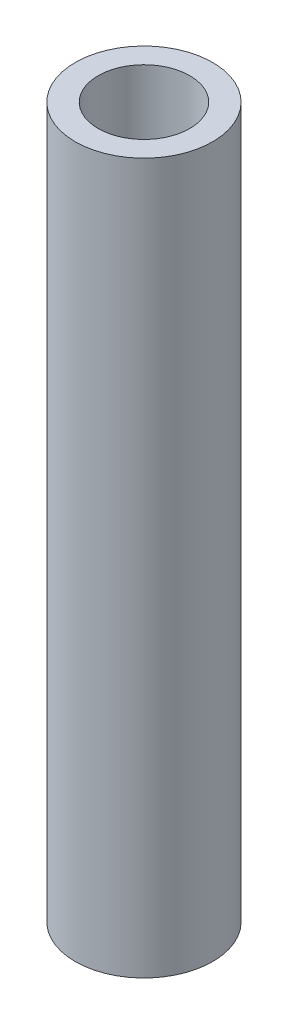
ISO-10303-21;
HEADER;
FILE_DESCRIPTION(('STEP AP214'),'2;1');
FILE_NAME('part.step','',(''),(''),'','','');
FILE_SCHEMA(('AUTOMOTIVE_DESIGN { 1 0 10303 214 1 1 1 1 }'));
ENDSEC;
DATA;
#1=APPLICATION_CONTEXT('core data for automotive mechanical design processes');
#2=APPLICATION_PROTOCOL_DEFINITION('international standard','automotive_design',2000,#1);
#3=PRODUCT_CONTEXT('',#1,'mechanical');
#4=PRODUCT('Part','Part','',(#3));
#5=PRODUCT_RELATED_PRODUCT_CATEGORY('part','',(#4));
#6=PRODUCT_DEFINITION_FORMATION('','',#4);
#7=PRODUCT_DEFINITION_CONTEXT('part definition',#1,'design');
#8=PRODUCT_DEFINITION('design','',#6,#7);
#9=PRODUCT_DEFINITION_SHAPE('','',#8);
#10=(LENGTH_UNIT() NAMED_UNIT(*) SI_UNIT(.MILLI.,.METRE.));
#11=(NAMED_UNIT(*) PLANE_ANGLE_UNIT() SI_UNIT($,.RADIAN.));
#12=(NAMED_UNIT(*) SI_UNIT($,.STERADIAN.) SOLID_ANGLE_UNIT());
#13=UNCERTAINTY_MEASURE_WITH_UNIT(LENGTH_MEASURE(1.E-05),#10,'distance_accuracy_value','');
#14=(GEOMETRIC_REPRESENTATION_CONTEXT(3) GLOBAL_UNCERTAINTY_ASSIGNED_CONTEXT((#13)) GLOBAL_UNIT_ASSIGNED_CONTEXT((#10,
#11,#12)) REPRESENTATION_CONTEXT('',''));
#15=CARTESIAN_POINT('',(0.,0.,0.));
#16=DIRECTION('',(0.,0.,1.));
#17=DIRECTION('',(1.,0.,0.));
#18=AXIS2_PLACEMENT_3D('',#15,#16,#17);
#19=CARTESIAN_POINT('',(0.,62.,0.));
#20=DIRECTION('',(0.,1.,0.));
#21=DIRECTION('',(0.,0.,1.));
#22=AXIS2_PLACEMENT_3D('',#19,#20,#21);
#23=PLANE('',#22);
#24=CARTESIAN_POINT('',(0.,62.,0.));
#25=DIRECTION('',(0.,1.,0.));
#26=DIRECTION('',(0.,0.,1.));
#27=AXIS2_PLACEMENT_3D('',#24,#25,#26);
#28=CIRCLE('',#27,6.);
#29=CARTESIAN_POINT('',(0.,62.,6.));
#30=VERTEX_POINT('',#29);
#31=EDGE_CURVE('E10',#30,#30,#28,.T.);
#32=ORIENTED_EDGE('',*,*,#31,.T.);
#33=EDGE_LOOP('',(#32));
#34=FACE_BOUND('',#33,.T.);
#35=CARTESIAN_POINT('',(0.,62.,0.));
#36=DIRECTION('',(0.,1.,0.));
#37=DIRECTION('',(0.,0.,1.));
#38=AXIS2_PLACEMENT_3D('',#35,#36,#37);
#39=CIRCLE('',#38,4.);
#40=CARTESIAN_POINT('',(0.,62.,4.));
#41=VERTEX_POINT('',#40);
#42=EDGE_CURVE('E42',#41,#41,#39,.T.);
#43=ORIENTED_EDGE('',*,*,#42,.F.);
#44=EDGE_LOOP('',(#43));
#45=FACE_BOUND('',#44,.T.);
#46=ADVANCED_FACE('F31',(#34,#45),#23,.T.);
#47=CARTESIAN_POINT('',(0.,0.,0.));
#48=DIRECTION('',(0.,1.,0.));
#49=DIRECTION('',(0.,0.,1.));
#50=AXIS2_PLACEMENT_3D('',#47,#48,#49);
#51=PLANE('',#50);
#52=CARTESIAN_POINT('',(0.,0.,0.));
#53=DIRECTION('',(0.,1.,0.));
#54=DIRECTION('',(0.,0.,1.));
#55=AXIS2_PLACEMENT_3D('',#52,#53,#54);
#56=CIRCLE('',#55,6.);
#57=CARTESIAN_POINT('',(0.,0.,6.));
#58=VERTEX_POINT('',#57);
#59=EDGE_CURVE('E35',#58,#58,#56,.T.);
#60=ORIENTED_EDGE('',*,*,#59,.F.);
#61=EDGE_LOOP('',(#60));
#62=FACE_BOUND('',#61,.T.);
#63=CARTESIAN_POINT('',(0.,0.,0.));
#64=DIRECTION('',(0.,1.,0.));
#65=DIRECTION('',(0.,0.,1.));
#66=AXIS2_PLACEMENT_3D('',#63,#64,#65);
#67=CIRCLE('',#66,4.);
#68=CARTESIAN_POINT('',(0.,0.,4.));
#69=VERTEX_POINT('',#68);
#70=EDGE_CURVE('E44',#69,#69,#67,.T.);
#71=ORIENTED_EDGE('',*,*,#70,.T.);
#72=EDGE_LOOP('',(#71));
#73=FACE_BOUND('',#72,.T.);
#74=ADVANCED_FACE('F54',(#62,#73),#51,.F.);
#75=CARTESIAN_POINT('',(0.,62.,0.));
#76=DIRECTION('',(0.,-1.,0.));
#77=DIRECTION('',(0.,0.,-1.));
#78=AXIS2_PLACEMENT_3D('',#75,#76,#77);
#79=CYLINDRICAL_SURFACE('',#78,6.);
#80=ORIENTED_EDGE('',*,*,#31,.F.);
#81=EDGE_LOOP('',(#80));
#82=FACE_BOUND('',#81,.T.);
#83=ORIENTED_EDGE('',*,*,#59,.T.);
#84=EDGE_LOOP('',(#83));
#85=FACE_BOUND('',#84,.T.);
#86=ADVANCED_FACE('F33',(#82,#85),#79,.T.);
#87=CARTESIAN_POINT('',(0.,62.,0.));
#88=DIRECTION('',(0.,-1.,0.));
#89=DIRECTION('',(0.,0.,-1.));
#90=AXIS2_PLACEMENT_3D('',#87,#88,#89);
#91=CYLINDRICAL_SURFACE('',#90,4.);
#92=ORIENTED_EDGE('',*,*,#42,.T.);
#93=EDGE_LOOP('',(#92));
#94=FACE_BOUND('',#93,.T.);
#95=ORIENTED_EDGE('',*,*,#70,.F.);
#96=EDGE_LOOP('',(#95));
#97=FACE_BOUND('',#96,.T.);
#98=ADVANCED_FACE('F50',(#94,#97),#91,.F.);
#99=CLOSED_SHELL('',(#46,#74,#86,#98));
#100=MANIFOLD_SOLID_BREP('B2',#99);
#101=ADVANCED_BREP_SHAPE_REPRESENTATION('',(#18,#100),#14);
#102=SHAPE_DEFINITION_REPRESENTATION(#9,#101);
ENDSEC;
END-ISO-10303-21;
